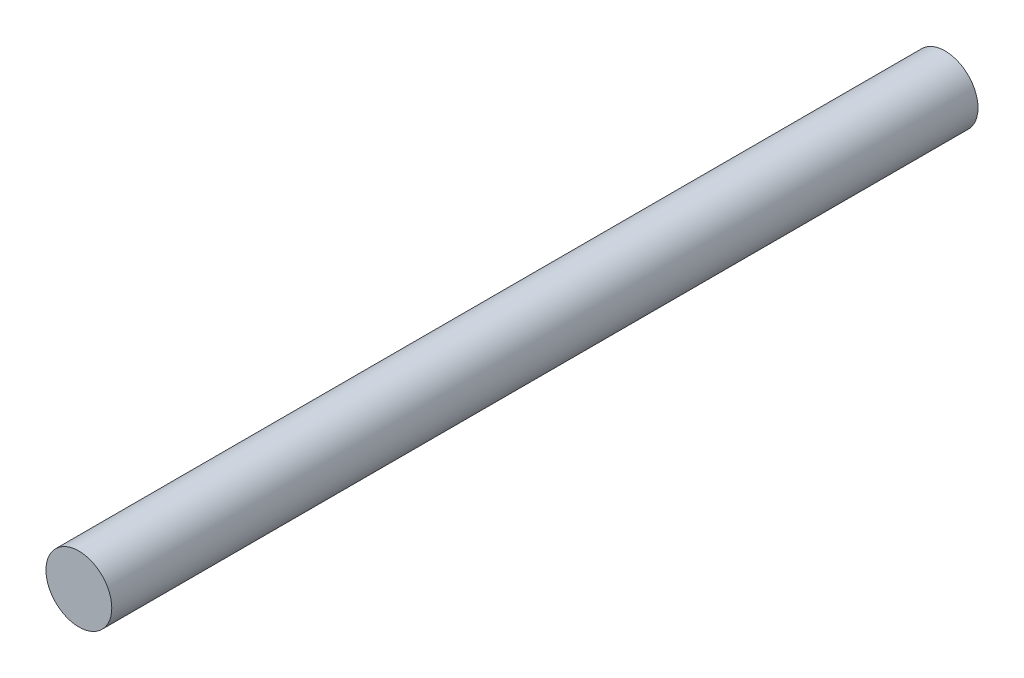
ISO-10303-21;
HEADER;
FILE_DESCRIPTION(('STEP AP214'),'2;1');
FILE_NAME('part.step','',(''),(''),'','','');
FILE_SCHEMA(('AUTOMOTIVE_DESIGN { 1 0 10303 214 1 1 1 1 }'));
ENDSEC;
DATA;
#1=APPLICATION_CONTEXT('core data for automotive mechanical design processes');
#2=APPLICATION_PROTOCOL_DEFINITION('international standard','automotive_design',2000,#1);
#3=PRODUCT_CONTEXT('',#1,'mechanical');
#4=PRODUCT('Part','Part','',(#3));
#5=PRODUCT_RELATED_PRODUCT_CATEGORY('part','',(#4));
#6=PRODUCT_DEFINITION_FORMATION('','',#4);
#7=PRODUCT_DEFINITION_CONTEXT('part definition',#1,'design');
#8=PRODUCT_DEFINITION('design','',#6,#7);
#9=PRODUCT_DEFINITION_SHAPE('','',#8);
#10=(LENGTH_UNIT() NAMED_UNIT(*) SI_UNIT(.MILLI.,.METRE.));
#11=(NAMED_UNIT(*) PLANE_ANGLE_UNIT() SI_UNIT($,.RADIAN.));
#12=(NAMED_UNIT(*) SI_UNIT($,.STERADIAN.) SOLID_ANGLE_UNIT());
#13=UNCERTAINTY_MEASURE_WITH_UNIT(LENGTH_MEASURE(1.E-05),#10,'distance_accuracy_value','');
#14=(GEOMETRIC_REPRESENTATION_CONTEXT(3) GLOBAL_UNCERTAINTY_ASSIGNED_CONTEXT((#13)) GLOBAL_UNIT_ASSIGNED_CONTEXT((#10,
#11,#12)) REPRESENTATION_CONTEXT('',''));
#15=CARTESIAN_POINT('',(0.,0.,0.));
#16=DIRECTION('',(0.,0.,1.));
#17=DIRECTION('',(1.,0.,0.));
#18=AXIS2_PLACEMENT_3D('',#15,#16,#17);
#19=CARTESIAN_POINT('',(2.78880516684604,15.1989881593111,105.25));
#20=DIRECTION('',(0.,0.,-1.));
#21=DIRECTION('',(-1.,0.,0.));
#22=AXIS2_PLACEMENT_3D('',#19,#20,#21);
#23=CYLINDRICAL_SURFACE('',#22,4.);
#24=CARTESIAN_POINT('',(2.78880516684604,15.1989881593111,105.25));
#25=DIRECTION('',(0.,0.,1.));
#26=DIRECTION('',(1.,0.,0.));
#27=AXIS2_PLACEMENT_3D('',#24,#25,#26);
#28=CIRCLE('',#27,4.);
#29=CARTESIAN_POINT('',(6.78880516684604,15.1989881593111,105.25));
#30=VERTEX_POINT('',#29);
#31=EDGE_CURVE('E10',#30,#30,#28,.T.);
#32=ORIENTED_EDGE('',*,*,#31,.F.);
#33=EDGE_LOOP('',(#32));
#34=FACE_BOUND('',#33,.T.);
#35=CARTESIAN_POINT('',(2.78880516684604,15.1989881593111,0.));
#36=DIRECTION('',(0.,0.,1.));
#37=DIRECTION('',(1.,0.,0.));
#38=AXIS2_PLACEMENT_3D('',#35,#36,#37);
#39=CIRCLE('',#38,4.);
#40=CARTESIAN_POINT('',(6.78880516684604,15.1989881593111,0.));
#41=VERTEX_POINT('',#40);
#42=EDGE_CURVE('E36',#41,#41,#39,.T.);
#43=ORIENTED_EDGE('',*,*,#42,.T.);
#44=EDGE_LOOP('',(#43));
#45=FACE_BOUND('',#44,.T.);
#46=ADVANCED_FACE('F33',(#34,#45),#23,.T.);
#47=CARTESIAN_POINT('',(2.78880516684604,15.1989881593111,105.25));
#48=DIRECTION('',(0.,0.,1.));
#49=DIRECTION('',(1.,0.,0.));
#50=AXIS2_PLACEMENT_3D('',#47,#48,#49);
#51=PLANE('',#50);
#52=ORIENTED_EDGE('',*,*,#31,.T.);
#53=EDGE_LOOP('',(#52));
#54=FACE_BOUND('',#53,.T.);
#55=ADVANCED_FACE('F48',(#54),#51,.T.);
#56=CARTESIAN_POINT('',(2.78880516684604,15.1989881593111,0.));
#57=DIRECTION('',(0.,0.,1.));
#58=DIRECTION('',(1.,0.,0.));
#59=AXIS2_PLACEMENT_3D('',#56,#57,#58);
#60=PLANE('',#59);
#61=ORIENTED_EDGE('',*,*,#42,.F.);
#62=EDGE_LOOP('',(#61));
#63=FACE_BOUND('',#62,.T.);
#64=ADVANCED_FACE('F46',(#63),#60,.F.);
#65=CLOSED_SHELL('',(#46,#55,#64));
#66=MANIFOLD_SOLID_BREP('B2',#65);
#67=ADVANCED_BREP_SHAPE_REPRESENTATION('',(#18,#66),#14);
#68=SHAPE_DEFINITION_REPRESENTATION(#9,#67);
ENDSEC;
END-ISO-10303-21;
